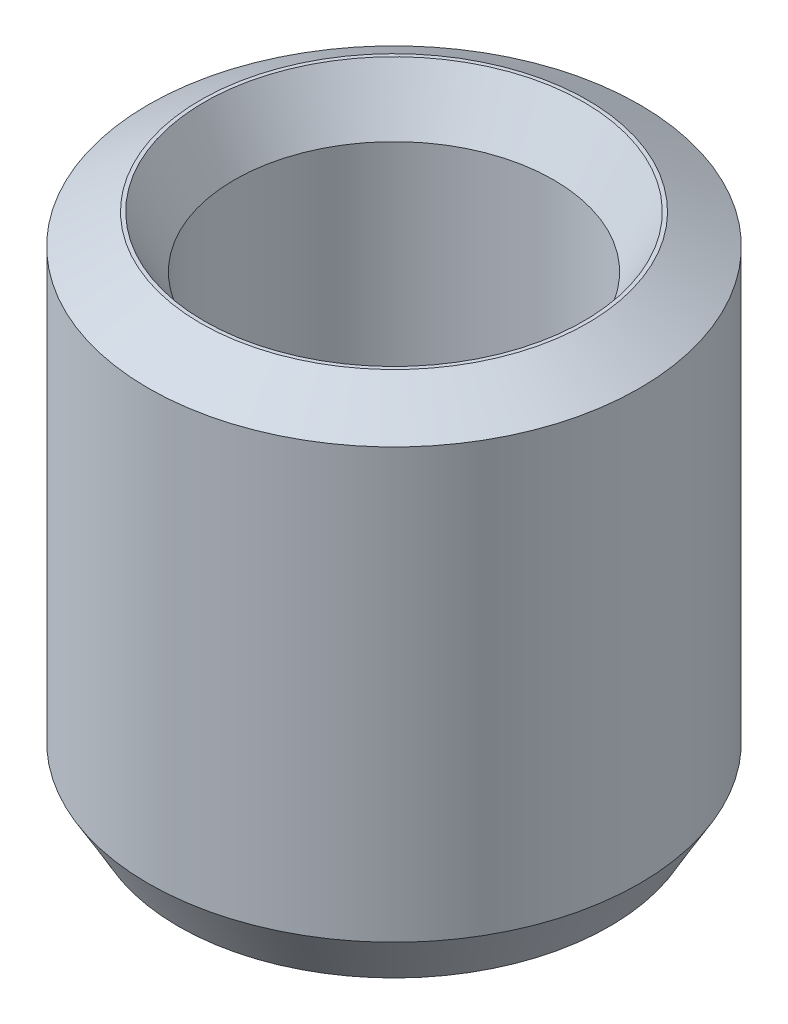
ISO-10303-21;
HEADER;
FILE_DESCRIPTION(('STEP AP214'),'2;1');
FILE_NAME('part.step','',(''),(''),'','','');
FILE_SCHEMA(('AUTOMOTIVE_DESIGN { 1 0 10303 214 1 1 1 1 }'));
ENDSEC;
DATA;
#1=APPLICATION_CONTEXT('core data for automotive mechanical design processes');
#2=APPLICATION_PROTOCOL_DEFINITION('international standard','automotive_design',2000,#1);
#3=PRODUCT_CONTEXT('',#1,'mechanical');
#4=PRODUCT('Part','Part','',(#3));
#5=PRODUCT_RELATED_PRODUCT_CATEGORY('part','',(#4));
#6=PRODUCT_DEFINITION_FORMATION('','',#4);
#7=PRODUCT_DEFINITION_CONTEXT('part definition',#1,'design');
#8=PRODUCT_DEFINITION('design','',#6,#7);
#9=PRODUCT_DEFINITION_SHAPE('','',#8);
#10=(LENGTH_UNIT() NAMED_UNIT(*) SI_UNIT(.MILLI.,.METRE.));
#11=(NAMED_UNIT(*) PLANE_ANGLE_UNIT() SI_UNIT($,.RADIAN.));
#12=(NAMED_UNIT(*) SI_UNIT($,.STERADIAN.) SOLID_ANGLE_UNIT());
#13=UNCERTAINTY_MEASURE_WITH_UNIT(LENGTH_MEASURE(1.E-05),#10,'distance_accuracy_value','');
#14=(GEOMETRIC_REPRESENTATION_CONTEXT(3) GLOBAL_UNCERTAINTY_ASSIGNED_CONTEXT((#13)) GLOBAL_UNIT_ASSIGNED_CONTEXT((#10,
#11,#12)) REPRESENTATION_CONTEXT('',''));
#15=CARTESIAN_POINT('',(0.,0.,0.));
#16=DIRECTION('',(0.,0.,1.));
#17=DIRECTION('',(1.,0.,0.));
#18=AXIS2_PLACEMENT_3D('',#15,#16,#17);
#19=CARTESIAN_POINT('',(0.,15.6124626877894,0.));
#20=DIRECTION('',(0.,-1.,0.));
#21=DIRECTION('',(0.,0.,-1.));
#22=AXIS2_PLACEMENT_3D('',#19,#20,#21);
#23=CYLINDRICAL_SURFACE('',#22,7.5);
#24=CARTESIAN_POINT('',(0.,1.59430604416528,0.));
#25=DIRECTION('',(0.,1.,0.));
#26=DIRECTION('',(0.,0.,1.));
#27=AXIS2_PLACEMENT_3D('',#24,#25,#26);
#28=CIRCLE('',#27,7.5);
#29=CARTESIAN_POINT('',(0.,1.59430604416528,7.5));
#30=VERTEX_POINT('',#29);
#31=EDGE_CURVE('E10',#30,#30,#28,.T.);
#32=ORIENTED_EDGE('',*,*,#31,.T.);
#33=EDGE_LOOP('',(#32));
#34=FACE_BOUND('',#33,.T.);
#35=CARTESIAN_POINT('',(0.,14.6919896640199,0.));
#36=DIRECTION('',(0.,1.,0.));
#37=DIRECTION('',(0.,0.,1.));
#38=AXIS2_PLACEMENT_3D('',#35,#36,#37);
#39=CIRCLE('',#38,7.5);
#40=CARTESIAN_POINT('',(0.,14.6919896640199,7.5));
#41=VERTEX_POINT('',#40);
#42=EDGE_CURVE('E50',#41,#41,#39,.F.);
#43=ORIENTED_EDGE('',*,*,#42,.T.);
#44=EDGE_LOOP('',(#43));
#45=FACE_BOUND('',#44,.T.);
#46=ADVANCED_FACE('F39',(#34,#45),#23,.T.);
#47=CARTESIAN_POINT('',(0.,15.6124626877894,0.));
#48=DIRECTION('',(0.,1.,0.));
#49=DIRECTION('',(0.,0.,1.));
#50=AXIS2_PLACEMENT_3D('',#47,#48,#49);
#51=PLANE('',#50);
#52=CARTESIAN_POINT('',(0.,15.6124626877894,0.));
#53=DIRECTION('',(0.,1.,0.));
#54=DIRECTION('',(0.,0.,1.));
#55=AXIS2_PLACEMENT_3D('',#52,#53,#54);
#56=CIRCLE('',#55,5.79267175119473);
#57=CARTESIAN_POINT('',(0.,15.6124626877894,5.79267175119473));
#58=VERTEX_POINT('',#57);
#59=EDGE_CURVE('E58',#58,#58,#56,.F.);
#60=ORIENTED_EDGE('',*,*,#59,.T.);
#61=EDGE_LOOP('',(#60));
#62=FACE_BOUND('',#61,.T.);
#63=CARTESIAN_POINT('',(0.,15.6124626877894,0.));
#64=DIRECTION('',(0.,1.,0.));
#65=DIRECTION('',(0.,0.,1.));
#66=AXIS2_PLACEMENT_3D('',#63,#64,#65);
#67=CIRCLE('',#66,5.90569395583471);
#68=CARTESIAN_POINT('',(0.,15.6124626877894,5.90569395583471));
#69=VERTEX_POINT('',#68);
#70=EDGE_CURVE('E61',#69,#69,#67,.T.);
#71=ORIENTED_EDGE('',*,*,#70,.T.);
#72=EDGE_LOOP('',(#71));
#73=FACE_BOUND('',#72,.T.);
#74=ADVANCED_FACE('F88',(#62,#73),#51,.T.);
#75=CARTESIAN_POINT('',(0.,0.,0.));
#76=DIRECTION('',(0.,1.,0.));
#77=DIRECTION('',(0.,0.,1.));
#78=AXIS2_PLACEMENT_3D('',#75,#76,#77);
#79=PLANE('',#78);
#80=CARTESIAN_POINT('',(0.,0.,0.));
#81=DIRECTION('',(0.,1.,0.));
#82=DIRECTION('',(0.,0.,1.));
#83=AXIS2_PLACEMENT_3D('',#80,#81,#82);
#84=CIRCLE('',#83,6.46650477159053);
#85=CARTESIAN_POINT('',(0.,0.,6.46650477159053));
#86=VERTEX_POINT('',#85);
#87=EDGE_CURVE('E51',#86,#86,#84,.T.);
#88=ORIENTED_EDGE('',*,*,#87,.T.);
#89=EDGE_LOOP('',(#88));
#90=FACE_BOUND('',#89,.T.);
#91=CARTESIAN_POINT('',(0.,0.,0.));
#92=DIRECTION('',(0.,1.,0.));
#93=DIRECTION('',(0.,0.,1.));
#94=AXIS2_PLACEMENT_3D('',#91,#92,#93);
#95=CIRCLE('',#94,6.57952697623052);
#96=CARTESIAN_POINT('',(0.,0.,6.57952697623052));
#97=VERTEX_POINT('',#96);
#98=EDGE_CURVE('E54',#97,#97,#95,.F.);
#99=ORIENTED_EDGE('',*,*,#98,.T.);
#100=EDGE_LOOP('',(#99));
#101=FACE_BOUND('',#100,.T.);
#102=ADVANCED_FACE('F83',(#90,#101),#79,.F.);
#103=CARTESIAN_POINT('',(0.,15.6124626877894,0.));
#104=DIRECTION('',(0.,-1.,0.));
#105=DIRECTION('',(0.,0.,-1.));
#106=AXIS2_PLACEMENT_3D('',#103,#104,#105);
#107=CYLINDRICAL_SURFACE('',#106,4.87219872742525);
#108=CARTESIAN_POINT('',(0.,14.0181566436241,0.));
#109=DIRECTION('',(0.,1.,0.));
#110=DIRECTION('',(0.,0.,1.));
#111=AXIS2_PLACEMENT_3D('',#108,#109,#110);
#112=CIRCLE('',#111,4.87219872742525);
#113=CARTESIAN_POINT('',(0.,14.0181566436241,4.87219872742525));
#114=VERTEX_POINT('',#113);
#115=EDGE_CURVE('E67',#114,#114,#112,.T.);
#116=ORIENTED_EDGE('',*,*,#115,.T.);
#117=EDGE_LOOP('',(#116));
#118=FACE_BOUND('',#117,.T.);
#119=CARTESIAN_POINT('',(0.,0.920473023769479,0.));
#120=DIRECTION('',(0.,1.,0.));
#121=DIRECTION('',(0.,0.,1.));
#122=AXIS2_PLACEMENT_3D('',#119,#120,#121);
#123=CIRCLE('',#122,4.87219872742525);
#124=CARTESIAN_POINT('',(0.,0.920473023769479,4.87219872742525));
#125=VERTEX_POINT('',#124);
#126=EDGE_CURVE('E69',#125,#125,#123,.F.);
#127=ORIENTED_EDGE('',*,*,#126,.T.);
#128=EDGE_LOOP('',(#127));
#129=FACE_BOUND('',#128,.T.);
#130=ADVANCED_FACE('F71',(#118,#129),#107,.F.);
#131=CARTESIAN_POINT('',(0.,14.0181566436241,0.));
#132=DIRECTION('',(0.,1.,0.));
#133=DIRECTION('',(0.,0.,1.));
#134=AXIS2_PLACEMENT_3D('',#131,#132,#133);
#135=CONICAL_SURFACE('',#134,4.87219872742525,0.523598775598302);
#136=ORIENTED_EDGE('',*,*,#59,.F.);
#137=EDGE_LOOP('',(#136));
#138=FACE_BOUND('',#137,.T.);
#139=ORIENTED_EDGE('',*,*,#115,.F.);
#140=EDGE_LOOP('',(#139));
#141=FACE_BOUND('',#140,.T.);
#142=ADVANCED_FACE('F77',(#138,#141),#135,.F.);
#143=CARTESIAN_POINT('',(0.,0.,0.));
#144=DIRECTION('',(0.,-1.,0.));
#145=DIRECTION('',(0.,0.,-1.));
#146=AXIS2_PLACEMENT_3D('',#143,#144,#145);
#147=CONICAL_SURFACE('',#146,6.46650477159053,1.04719755119659);
#148=ORIENTED_EDGE('',*,*,#126,.F.);
#149=EDGE_LOOP('',(#148));
#150=FACE_BOUND('',#149,.T.);
#151=ORIENTED_EDGE('',*,*,#87,.F.);
#152=EDGE_LOOP('',(#151));
#153=FACE_BOUND('',#152,.T.);
#154=ADVANCED_FACE('F73',(#150,#153),#147,.F.);
#155=CARTESIAN_POINT('',(0.,1.59430604416528,0.));
#156=DIRECTION('',(0.,1.,0.));
#157=DIRECTION('',(0.,0.,1.));
#158=AXIS2_PLACEMENT_3D('',#155,#156,#157);
#159=CONICAL_SURFACE('',#158,7.5,0.523598775598302);
#160=ORIENTED_EDGE('',*,*,#98,.F.);
#161=EDGE_LOOP('',(#160));
#162=FACE_BOUND('',#161,.T.);
#163=ORIENTED_EDGE('',*,*,#31,.F.);
#164=EDGE_LOOP('',(#163));
#165=FACE_BOUND('',#164,.T.);
#166=ADVANCED_FACE('F76',(#162,#165),#159,.T.);
#167=CARTESIAN_POINT('',(0.,15.6124626877894,0.));
#168=DIRECTION('',(0.,-1.,0.));
#169=DIRECTION('',(0.,0.,-1.));
#170=AXIS2_PLACEMENT_3D('',#167,#168,#169);
#171=CONICAL_SURFACE('',#170,5.90569395583471,1.04719755119659);
#172=ORIENTED_EDGE('',*,*,#42,.F.);
#173=EDGE_LOOP('',(#172));
#174=FACE_BOUND('',#173,.T.);
#175=ORIENTED_EDGE('',*,*,#70,.F.);
#176=EDGE_LOOP('',(#175));
#177=FACE_BOUND('',#176,.T.);
#178=ADVANCED_FACE('F45',(#174,#177),#171,.T.);
#179=CLOSED_SHELL('',(#46,#74,#102,#130,#142,#154,#166,#178));
#180=MANIFOLD_SOLID_BREP('B2',#179);
#181=ADVANCED_BREP_SHAPE_REPRESENTATION('',(#18,#180),#14);
#182=SHAPE_DEFINITION_REPRESENTATION(#9,#181);
ENDSEC;
END-ISO-10303-21;
